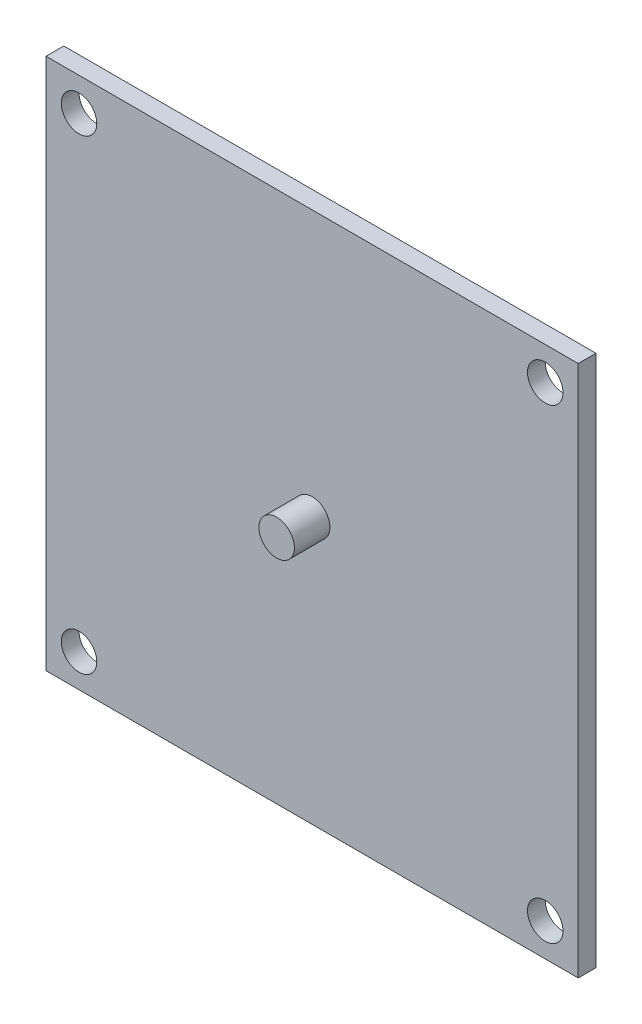
ISO-10303-21;
HEADER;
FILE_DESCRIPTION(('STEP AP214'),'2;1');
FILE_NAME('part.step','',(''),(''),'','','');
FILE_SCHEMA(('AUTOMOTIVE_DESIGN { 1 0 10303 214 1 1 1 1 }'));
ENDSEC;
DATA;
#1=APPLICATION_CONTEXT('core data for automotive mechanical design processes');
#2=APPLICATION_PROTOCOL_DEFINITION('international standard','automotive_design',2000,#1);
#3=PRODUCT_CONTEXT('',#1,'mechanical');
#4=PRODUCT('Part','Part','',(#3));
#5=PRODUCT_RELATED_PRODUCT_CATEGORY('part','',(#4));
#6=PRODUCT_DEFINITION_FORMATION('','',#4);
#7=PRODUCT_DEFINITION_CONTEXT('part definition',#1,'design');
#8=PRODUCT_DEFINITION('design','',#6,#7);
#9=PRODUCT_DEFINITION_SHAPE('','',#8);
#10=(LENGTH_UNIT() NAMED_UNIT(*) SI_UNIT(.MILLI.,.METRE.));
#11=(NAMED_UNIT(*) PLANE_ANGLE_UNIT() SI_UNIT($,.RADIAN.));
#12=(NAMED_UNIT(*) SI_UNIT($,.STERADIAN.) SOLID_ANGLE_UNIT());
#13=UNCERTAINTY_MEASURE_WITH_UNIT(LENGTH_MEASURE(1.E-05),#10,'distance_accuracy_value','');
#14=(GEOMETRIC_REPRESENTATION_CONTEXT(3) GLOBAL_UNCERTAINTY_ASSIGNED_CONTEXT((#13)) GLOBAL_UNIT_ASSIGNED_CONTEXT((#10,
#11,#12)) REPRESENTATION_CONTEXT('',''));
#15=CARTESIAN_POINT('',(0.,0.,0.));
#16=DIRECTION('',(0.,0.,1.));
#17=DIRECTION('',(1.,0.,0.));
#18=AXIS2_PLACEMENT_3D('',#15,#16,#17);
#19=CARTESIAN_POINT('',(15.,15.,1.));
#20=DIRECTION('',(-1.,0.,0.));
#21=DIRECTION('',(0.,-1.,0.));
#22=AXIS2_PLACEMENT_3D('',#19,#20,#21);
#23=PLANE('',#22);
#24=DIRECTION('',(0.,1.,0.));
#25=VECTOR('',#24,1.);
#26=CARTESIAN_POINT('',(15.,15.,0.));
#27=LINE('',#26,#25);
#28=CARTESIAN_POINT('',(15.,-15.,0.));
#29=VERTEX_POINT('',#28);
#30=CARTESIAN_POINT('',(15.,15.,0.));
#31=VERTEX_POINT('',#30);
#32=EDGE_CURVE('E96',#29,#31,#27,.T.);
#33=ORIENTED_EDGE('',*,*,#32,.T.);
#34=DIRECTION('',(0.,0.,-1.));
#35=VECTOR('',#34,1.);
#36=CARTESIAN_POINT('',(15.,15.,1.));
#37=LINE('',#36,#35);
#38=CARTESIAN_POINT('',(15.,15.,1.));
#39=VERTEX_POINT('',#38);
#40=EDGE_CURVE('E11',#39,#31,#37,.T.);
#41=ORIENTED_EDGE('',*,*,#40,.F.);
#42=DIRECTION('',(0.,1.,0.));
#43=VECTOR('',#42,1.);
#44=CARTESIAN_POINT('',(15.,15.,1.));
#45=LINE('',#44,#43);
#46=CARTESIAN_POINT('',(15.,-15.,1.));
#47=VERTEX_POINT('',#46);
#48=EDGE_CURVE('E84',#47,#39,#45,.T.);
#49=ORIENTED_EDGE('',*,*,#48,.F.);
#50=DIRECTION('',(0.,0.,-1.));
#51=VECTOR('',#50,1.);
#52=CARTESIAN_POINT('',(15.,-15.,1.));
#53=LINE('',#52,#51);
#54=EDGE_CURVE('E92',#47,#29,#53,.T.);
#55=ORIENTED_EDGE('',*,*,#54,.T.);
#56=EDGE_LOOP('',(#33,#41,#49,#55));
#57=FACE_BOUND('',#56,.T.);
#58=ADVANCED_FACE('F33',(#57),#23,.F.);
#59=CARTESIAN_POINT('',(-15.,15.,1.));
#60=DIRECTION('',(0.,-1.,0.));
#61=DIRECTION('',(0.,0.,-1.));
#62=AXIS2_PLACEMENT_3D('',#59,#60,#61);
#63=PLANE('',#62);
#64=DIRECTION('',(-1.,0.,0.));
#65=VECTOR('',#64,1.);
#66=CARTESIAN_POINT('',(-15.,15.,0.));
#67=LINE('',#66,#65);
#68=CARTESIAN_POINT('',(-15.,15.,0.));
#69=VERTEX_POINT('',#68);
#70=EDGE_CURVE('E88',#31,#69,#67,.T.);
#71=ORIENTED_EDGE('',*,*,#70,.T.);
#72=DIRECTION('',(0.,0.,-1.));
#73=VECTOR('',#72,1.);
#74=CARTESIAN_POINT('',(-15.,15.,1.));
#75=LINE('',#74,#73);
#76=CARTESIAN_POINT('',(-15.,15.,1.));
#77=VERTEX_POINT('',#76);
#78=EDGE_CURVE('E41',#77,#69,#75,.T.);
#79=ORIENTED_EDGE('',*,*,#78,.F.);
#80=DIRECTION('',(-1.,0.,0.));
#81=VECTOR('',#80,1.);
#82=CARTESIAN_POINT('',(-15.,15.,1.));
#83=LINE('',#82,#81);
#84=EDGE_CURVE('E79',#39,#77,#83,.T.);
#85=ORIENTED_EDGE('',*,*,#84,.F.);
#86=ORIENTED_EDGE('',*,*,#40,.T.);
#87=EDGE_LOOP('',(#71,#79,#85,#86));
#88=FACE_BOUND('',#87,.T.);
#89=ADVANCED_FACE('F87',(#88),#63,.F.);
#90=CARTESIAN_POINT('',(-15.,15.,1.));
#91=DIRECTION('',(1.,0.,0.));
#92=DIRECTION('',(0.,1.,0.));
#93=AXIS2_PLACEMENT_3D('',#90,#91,#92);
#94=PLANE('',#93);
#95=DIRECTION('',(0.,-1.,0.));
#96=VECTOR('',#95,1.);
#97=CARTESIAN_POINT('',(-15.,15.,0.));
#98=LINE('',#97,#96);
#99=CARTESIAN_POINT('',(-15.,-15.,0.));
#100=VERTEX_POINT('',#99);
#101=EDGE_CURVE('E66',#69,#100,#98,.T.);
#102=ORIENTED_EDGE('',*,*,#101,.T.);
#103=DIRECTION('',(0.,0.,-1.));
#104=VECTOR('',#103,1.);
#105=CARTESIAN_POINT('',(-15.,-15.,1.));
#106=LINE('',#105,#104);
#107=CARTESIAN_POINT('',(-15.,-15.,1.));
#108=VERTEX_POINT('',#107);
#109=EDGE_CURVE('E89',#108,#100,#106,.T.);
#110=ORIENTED_EDGE('',*,*,#109,.F.);
#111=DIRECTION('',(0.,-1.,0.));
#112=VECTOR('',#111,1.);
#113=CARTESIAN_POINT('',(-15.,15.,1.));
#114=LINE('',#113,#112);
#115=EDGE_CURVE('E82',#77,#108,#114,.T.);
#116=ORIENTED_EDGE('',*,*,#115,.F.);
#117=ORIENTED_EDGE('',*,*,#78,.T.);
#118=EDGE_LOOP('',(#102,#110,#116,#117));
#119=FACE_BOUND('',#118,.T.);
#120=ADVANCED_FACE('F90',(#119),#94,.F.);
#121=CARTESIAN_POINT('',(-15.,-15.,1.));
#122=DIRECTION('',(0.,1.,0.));
#123=DIRECTION('',(0.,0.,1.));
#124=AXIS2_PLACEMENT_3D('',#121,#122,#123);
#125=PLANE('',#124);
#126=DIRECTION('',(1.,0.,0.));
#127=VECTOR('',#126,1.);
#128=CARTESIAN_POINT('',(-15.,-15.,0.));
#129=LINE('',#128,#127);
#130=EDGE_CURVE('E72',#100,#29,#129,.T.);
#131=ORIENTED_EDGE('',*,*,#130,.T.);
#132=ORIENTED_EDGE('',*,*,#54,.F.);
#133=DIRECTION('',(1.,0.,0.));
#134=VECTOR('',#133,1.);
#135=CARTESIAN_POINT('',(-15.,-15.,1.));
#136=LINE('',#135,#134);
#137=EDGE_CURVE('E49',#108,#47,#136,.T.);
#138=ORIENTED_EDGE('',*,*,#137,.F.);
#139=ORIENTED_EDGE('',*,*,#109,.T.);
#140=EDGE_LOOP('',(#131,#132,#138,#139));
#141=FACE_BOUND('',#140,.T.);
#142=ADVANCED_FACE('F104',(#141),#125,.F.);
#143=CARTESIAN_POINT('',(0.,0.,1.));
#144=DIRECTION('',(0.,0.,1.));
#145=DIRECTION('',(1.,0.,0.));
#146=AXIS2_PLACEMENT_3D('',#143,#144,#145);
#147=PLANE('',#146);
#148=CARTESIAN_POINT('',(0.,0.,1.));
#149=DIRECTION('',(0.,0.,1.));
#150=DIRECTION('',(1.,0.,0.));
#151=AXIS2_PLACEMENT_3D('',#148,#149,#150);
#152=CIRCLE('',#151,1.);
#153=CARTESIAN_POINT('',(1.,0.,1.));
#154=VERTEX_POINT('',#153);
#155=EDGE_CURVE('E134',#154,#154,#152,.T.);
#156=ORIENTED_EDGE('',*,*,#155,.F.);
#157=EDGE_LOOP('',(#156));
#158=FACE_BOUND('',#157,.T.);
#159=CARTESIAN_POINT('',(-13.1399999999993,-13.14,1.));
#160=DIRECTION('',(0.,0.,1.));
#161=DIRECTION('',(1.,0.,0.));
#162=AXIS2_PLACEMENT_3D('',#159,#160,#161);
#163=CIRCLE('',#162,1.00000000000039);
#164=CARTESIAN_POINT('',(-12.1399999999989,-13.14,1.));
#165=VERTEX_POINT('',#164);
#166=EDGE_CURVE('E116',#165,#165,#163,.T.);
#167=ORIENTED_EDGE('',*,*,#166,.F.);
#168=EDGE_LOOP('',(#167));
#169=FACE_BOUND('',#168,.T.);
#170=CARTESIAN_POINT('',(13.1400000000007,-13.1399999999993,1.));
#171=DIRECTION('',(0.,0.,1.));
#172=DIRECTION('',(1.,0.,0.));
#173=AXIS2_PLACEMENT_3D('',#170,#171,#172);
#174=CIRCLE('',#173,1.00000000000104);
#175=CARTESIAN_POINT('',(14.1400000000018,-13.1399999999993,1.));
#176=VERTEX_POINT('',#175);
#177=EDGE_CURVE('E123',#176,#176,#174,.T.);
#178=ORIENTED_EDGE('',*,*,#177,.F.);
#179=EDGE_LOOP('',(#178));
#180=FACE_BOUND('',#179,.T.);
#181=CARTESIAN_POINT('',(13.14,13.1400000000007,1.));
#182=DIRECTION('',(0.,0.,1.));
#183=DIRECTION('',(1.,0.,0.));
#184=AXIS2_PLACEMENT_3D('',#181,#182,#183);
#185=CIRCLE('',#184,1.00000000000077);
#186=CARTESIAN_POINT('',(14.1400000000008,13.1400000000007,1.));
#187=VERTEX_POINT('',#186);
#188=EDGE_CURVE('E129',#187,#187,#185,.T.);
#189=ORIENTED_EDGE('',*,*,#188,.F.);
#190=EDGE_LOOP('',(#189));
#191=FACE_BOUND('',#190,.T.);
#192=CARTESIAN_POINT('',(-13.14,13.14,1.));
#193=DIRECTION('',(0.,0.,1.));
#194=DIRECTION('',(1.,0.,0.));
#195=AXIS2_PLACEMENT_3D('',#192,#193,#194);
#196=CIRCLE('',#195,1.);
#197=CARTESIAN_POINT('',(-12.14,13.14,1.));
#198=VERTEX_POINT('',#197);
#199=EDGE_CURVE('E110',#198,#198,#196,.T.);
#200=ORIENTED_EDGE('',*,*,#199,.F.);
#201=EDGE_LOOP('',(#200));
#202=FACE_BOUND('',#201,.T.);
#203=ORIENTED_EDGE('',*,*,#48,.T.);
#204=ORIENTED_EDGE('',*,*,#84,.T.);
#205=ORIENTED_EDGE('',*,*,#115,.T.);
#206=ORIENTED_EDGE('',*,*,#137,.T.);
#207=EDGE_LOOP('',(#203,#204,#205,#206));
#208=FACE_BOUND('',#207,.T.);
#209=ADVANCED_FACE('F80',(#158,#169,#180,#191,#202,#208),#147,.T.);
#210=CARTESIAN_POINT('',(0.,0.,0.));
#211=DIRECTION('',(0.,0.,1.));
#212=DIRECTION('',(1.,0.,0.));
#213=AXIS2_PLACEMENT_3D('',#210,#211,#212);
#214=PLANE('',#213);
#215=CARTESIAN_POINT('',(-13.1399999999993,-13.14,0.));
#216=DIRECTION('',(0.,0.,1.));
#217=DIRECTION('',(1.,0.,0.));
#218=AXIS2_PLACEMENT_3D('',#215,#216,#217);
#219=CIRCLE('',#218,1.00000000000039);
#220=CARTESIAN_POINT('',(-12.1399999999989,-13.14,0.));
#221=VERTEX_POINT('',#220);
#222=EDGE_CURVE('E119',#221,#221,#219,.T.);
#223=ORIENTED_EDGE('',*,*,#222,.T.);
#224=EDGE_LOOP('',(#223));
#225=FACE_BOUND('',#224,.T.);
#226=CARTESIAN_POINT('',(13.1400000000007,-13.1399999999993,0.));
#227=DIRECTION('',(0.,0.,1.));
#228=DIRECTION('',(1.,0.,0.));
#229=AXIS2_PLACEMENT_3D('',#226,#227,#228);
#230=CIRCLE('',#229,1.00000000000104);
#231=CARTESIAN_POINT('',(14.1400000000018,-13.1399999999993,0.));
#232=VERTEX_POINT('',#231);
#233=EDGE_CURVE('E126',#232,#232,#230,.T.);
#234=ORIENTED_EDGE('',*,*,#233,.T.);
#235=EDGE_LOOP('',(#234));
#236=FACE_BOUND('',#235,.T.);
#237=CARTESIAN_POINT('',(13.14,13.1400000000007,0.));
#238=DIRECTION('',(0.,0.,1.));
#239=DIRECTION('',(1.,0.,0.));
#240=AXIS2_PLACEMENT_3D('',#237,#238,#239);
#241=CIRCLE('',#240,1.00000000000077);
#242=CARTESIAN_POINT('',(14.1400000000008,13.1400000000007,0.));
#243=VERTEX_POINT('',#242);
#244=EDGE_CURVE('E113',#243,#243,#241,.T.);
#245=ORIENTED_EDGE('',*,*,#244,.T.);
#246=EDGE_LOOP('',(#245));
#247=FACE_BOUND('',#246,.T.);
#248=CARTESIAN_POINT('',(-13.14,13.14,0.));
#249=DIRECTION('',(0.,0.,1.));
#250=DIRECTION('',(1.,0.,0.));
#251=AXIS2_PLACEMENT_3D('',#248,#249,#250);
#252=CIRCLE('',#251,1.);
#253=CARTESIAN_POINT('',(-12.14,13.14,0.));
#254=VERTEX_POINT('',#253);
#255=EDGE_CURVE('E99',#254,#254,#252,.T.);
#256=ORIENTED_EDGE('',*,*,#255,.T.);
#257=EDGE_LOOP('',(#256));
#258=FACE_BOUND('',#257,.T.);
#259=ORIENTED_EDGE('',*,*,#32,.F.);
#260=ORIENTED_EDGE('',*,*,#130,.F.);
#261=ORIENTED_EDGE('',*,*,#101,.F.);
#262=ORIENTED_EDGE('',*,*,#70,.F.);
#263=EDGE_LOOP('',(#259,#260,#261,#262));
#264=FACE_BOUND('',#263,.T.);
#265=ADVANCED_FACE('F107',(#225,#236,#247,#258,#264),#214,.F.);
#266=CARTESIAN_POINT('',(-13.14,13.14,0.));
#267=DIRECTION('',(0.,0.,1.));
#268=DIRECTION('',(1.,0.,0.));
#269=AXIS2_PLACEMENT_3D('',#266,#267,#268);
#270=CYLINDRICAL_SURFACE('',#269,1.);
#271=ORIENTED_EDGE('',*,*,#255,.F.);
#272=EDGE_LOOP('',(#271));
#273=FACE_BOUND('',#272,.T.);
#274=ORIENTED_EDGE('',*,*,#199,.T.);
#275=EDGE_LOOP('',(#274));
#276=FACE_BOUND('',#275,.T.);
#277=ADVANCED_FACE('F160',(#273,#276),#270,.F.);
#278=CARTESIAN_POINT('',(13.14,13.1400000000007,0.));
#279=DIRECTION('',(0.,0.,1.));
#280=DIRECTION('',(1.,0.,0.));
#281=AXIS2_PLACEMENT_3D('',#278,#279,#280);
#282=CYLINDRICAL_SURFACE('',#281,1.00000000000077);
#283=ORIENTED_EDGE('',*,*,#244,.F.);
#284=EDGE_LOOP('',(#283));
#285=FACE_BOUND('',#284,.T.);
#286=ORIENTED_EDGE('',*,*,#188,.T.);
#287=EDGE_LOOP('',(#286));
#288=FACE_BOUND('',#287,.T.);
#289=ADVANCED_FACE('F162',(#285,#288),#282,.F.);
#290=CARTESIAN_POINT('',(13.1400000000007,-13.1399999999993,0.));
#291=DIRECTION('',(0.,0.,1.));
#292=DIRECTION('',(1.,0.,0.));
#293=AXIS2_PLACEMENT_3D('',#290,#291,#292);
#294=CYLINDRICAL_SURFACE('',#293,1.00000000000104);
#295=ORIENTED_EDGE('',*,*,#233,.F.);
#296=EDGE_LOOP('',(#295));
#297=FACE_BOUND('',#296,.T.);
#298=ORIENTED_EDGE('',*,*,#177,.T.);
#299=EDGE_LOOP('',(#298));
#300=FACE_BOUND('',#299,.T.);
#301=ADVANCED_FACE('F169',(#297,#300),#294,.F.);
#302=CARTESIAN_POINT('',(-13.1399999999993,-13.14,0.));
#303=DIRECTION('',(0.,0.,1.));
#304=DIRECTION('',(1.,0.,0.));
#305=AXIS2_PLACEMENT_3D('',#302,#303,#304);
#306=CYLINDRICAL_SURFACE('',#305,1.00000000000039);
#307=ORIENTED_EDGE('',*,*,#222,.F.);
#308=EDGE_LOOP('',(#307));
#309=FACE_BOUND('',#308,.T.);
#310=ORIENTED_EDGE('',*,*,#166,.T.);
#311=EDGE_LOOP('',(#310));
#312=FACE_BOUND('',#311,.T.);
#313=ADVANCED_FACE('F145',(#309,#312),#306,.F.);
#314=CARTESIAN_POINT('',(0.,0.,3.));
#315=DIRECTION('',(0.,0.,-1.));
#316=DIRECTION('',(-1.,0.,0.));
#317=AXIS2_PLACEMENT_3D('',#314,#315,#316);
#318=CYLINDRICAL_SURFACE('',#317,1.);
#319=CARTESIAN_POINT('',(0.,0.,3.));
#320=DIRECTION('',(0.,0.,1.));
#321=DIRECTION('',(1.,0.,0.));
#322=AXIS2_PLACEMENT_3D('',#319,#320,#321);
#323=CIRCLE('',#322,1.);
#324=CARTESIAN_POINT('',(1.,0.,3.));
#325=VERTEX_POINT('',#324);
#326=EDGE_CURVE('E120',#325,#325,#323,.T.);
#327=ORIENTED_EDGE('',*,*,#326,.F.);
#328=EDGE_LOOP('',(#327));
#329=FACE_BOUND('',#328,.T.);
#330=ORIENTED_EDGE('',*,*,#155,.T.);
#331=EDGE_LOOP('',(#330));
#332=FACE_BOUND('',#331,.T.);
#333=ADVANCED_FACE('F142',(#329,#332),#318,.T.);
#334=CARTESIAN_POINT('',(0.,0.,3.));
#335=DIRECTION('',(0.,0.,1.));
#336=DIRECTION('',(1.,0.,0.));
#337=AXIS2_PLACEMENT_3D('',#334,#335,#336);
#338=PLANE('',#337);
#339=ORIENTED_EDGE('',*,*,#326,.T.);
#340=EDGE_LOOP('',(#339));
#341=FACE_BOUND('',#340,.T.);
#342=ADVANCED_FACE('F140',(#341),#338,.T.);
#343=CLOSED_SHELL('',(#58,#89,#120,#142,#209,#265,#277,#289,#301,#313,#333,#342));
#344=MANIFOLD_SOLID_BREP('B2',#343);
#345=ADVANCED_BREP_SHAPE_REPRESENTATION('',(#18,#344),#14);
#346=SHAPE_DEFINITION_REPRESENTATION(#9,#345);
ENDSEC;
END-ISO-10303-21;
